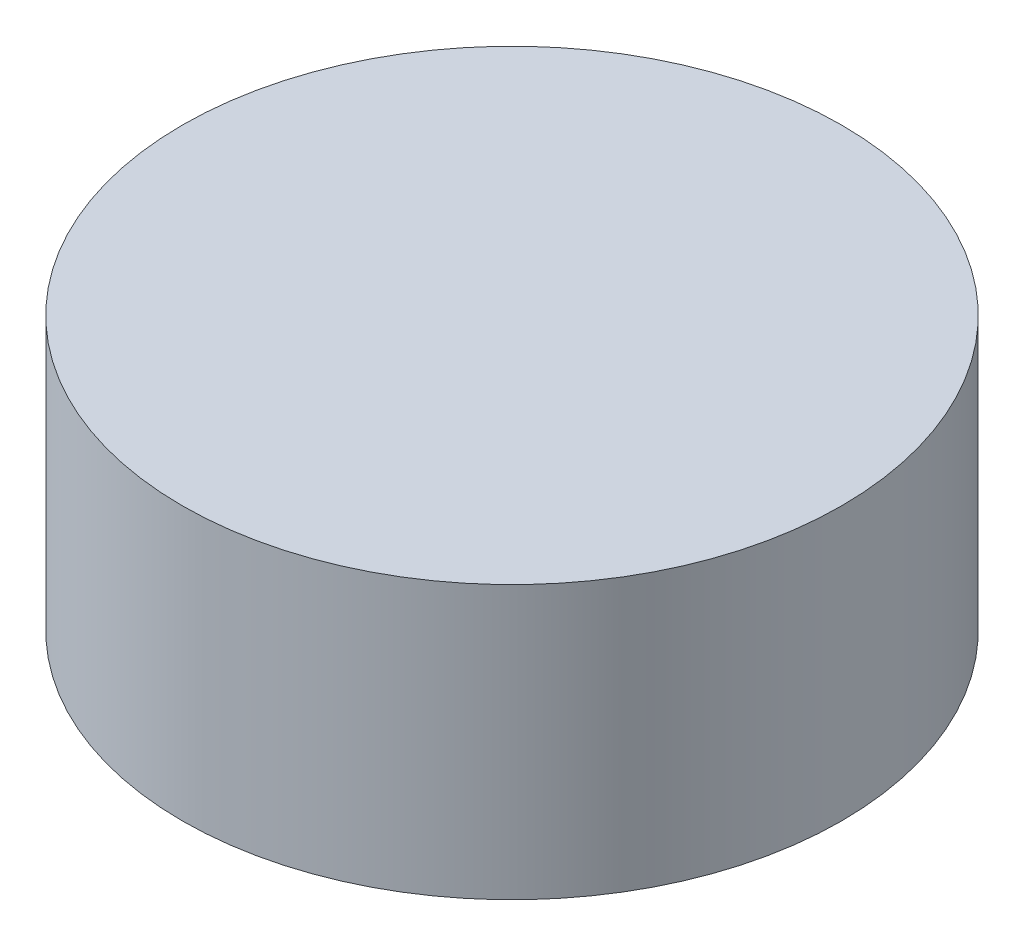
ISO-10303-21;
HEADER;
FILE_DESCRIPTION(('STEP AP214'),'2;1');
FILE_NAME('part.step','',(''),(''),'','','');
FILE_SCHEMA(('AUTOMOTIVE_DESIGN { 1 0 10303 214 1 1 1 1 }'));
ENDSEC;
DATA;
#1=APPLICATION_CONTEXT('core data for automotive mechanical design processes');
#2=APPLICATION_PROTOCOL_DEFINITION('international standard','automotive_design',2000,#1);
#3=PRODUCT_CONTEXT('',#1,'mechanical');
#4=PRODUCT('Part','Part','',(#3));
#5=PRODUCT_RELATED_PRODUCT_CATEGORY('part','',(#4));
#6=PRODUCT_DEFINITION_FORMATION('','',#4);
#7=PRODUCT_DEFINITION_CONTEXT('part definition',#1,'design');
#8=PRODUCT_DEFINITION('design','',#6,#7);
#9=PRODUCT_DEFINITION_SHAPE('','',#8);
#10=(LENGTH_UNIT() NAMED_UNIT(*) SI_UNIT(.MILLI.,.METRE.));
#11=(NAMED_UNIT(*) PLANE_ANGLE_UNIT() SI_UNIT($,.RADIAN.));
#12=(NAMED_UNIT(*) SI_UNIT($,.STERADIAN.) SOLID_ANGLE_UNIT());
#13=UNCERTAINTY_MEASURE_WITH_UNIT(LENGTH_MEASURE(1.E-05),#10,'distance_accuracy_value','');
#14=(GEOMETRIC_REPRESENTATION_CONTEXT(3) GLOBAL_UNCERTAINTY_ASSIGNED_CONTEXT((#13)) GLOBAL_UNIT_ASSIGNED_CONTEXT((#10,
#11,#12)) REPRESENTATION_CONTEXT('',''));
#15=CARTESIAN_POINT('',(0.,0.,0.));
#16=DIRECTION('',(0.,0.,1.));
#17=DIRECTION('',(1.,0.,0.));
#18=AXIS2_PLACEMENT_3D('',#15,#16,#17);
#19=CARTESIAN_POINT('',(-42.7866665549931,0.,20.4642477072215));
#20=DIRECTION('',(0.,1.,0.));
#21=DIRECTION('',(0.,0.,1.));
#22=AXIS2_PLACEMENT_3D('',#19,#20,#21);
#23=PLANE('',#22);
#24=CARTESIAN_POINT('',(-46.4462373264577,0.,0.));
#25=DIRECTION('',(0.,1.,0.));
#26=DIRECTION('',(0.,0.,1.));
#27=AXIS2_PLACEMENT_3D('',#24,#25,#26);
#28=CIRCLE('',#27,12.080035709711);
#29=CARTESIAN_POINT('',(-46.4462373264577,0.,12.080035709711));
#30=VERTEX_POINT('',#29);
#31=EDGE_CURVE('E10',#30,#30,#28,.T.);
#32=ORIENTED_EDGE('',*,*,#31,.F.);
#33=EDGE_LOOP('',(#32));
#34=FACE_BOUND('',#33,.T.);
#35=ADVANCED_FACE('F31',(#34),#23,.F.);
#36=CARTESIAN_POINT('',(-46.4462373264577,0.,0.));
#37=DIRECTION('',(0.,1.,0.));
#38=DIRECTION('',(0.,0.,1.));
#39=AXIS2_PLACEMENT_3D('',#36,#37,#38);
#40=CYLINDRICAL_SURFACE('',#39,12.080035709711);
#41=ORIENTED_EDGE('',*,*,#31,.T.);
#42=EDGE_LOOP('',(#41));
#43=FACE_BOUND('',#42,.T.);
#44=CARTESIAN_POINT('',(-46.4462373264577,10.,0.));
#45=DIRECTION('',(0.,1.,0.));
#46=DIRECTION('',(0.,0.,1.));
#47=AXIS2_PLACEMENT_3D('',#44,#45,#46);
#48=CIRCLE('',#47,12.080035709711);
#49=CARTESIAN_POINT('',(-46.4462373264577,10.,12.080035709711));
#50=VERTEX_POINT('',#49);
#51=EDGE_CURVE('E34',#50,#50,#48,.T.);
#52=ORIENTED_EDGE('',*,*,#51,.F.);
#53=EDGE_LOOP('',(#52));
#54=FACE_BOUND('',#53,.T.);
#55=ADVANCED_FACE('F45',(#43,#54),#40,.T.);
#56=CARTESIAN_POINT('',(-42.7866665549931,10.,20.4642477072215));
#57=DIRECTION('',(0.,1.,0.));
#58=DIRECTION('',(0.,0.,1.));
#59=AXIS2_PLACEMENT_3D('',#56,#57,#58);
#60=PLANE('',#59);
#61=ORIENTED_EDGE('',*,*,#51,.T.);
#62=EDGE_LOOP('',(#61));
#63=FACE_BOUND('',#62,.T.);
#64=ADVANCED_FACE('F43',(#63),#60,.T.);
#65=CLOSED_SHELL('',(#35,#55,#64));
#66=MANIFOLD_SOLID_BREP('B2',#65);
#67=ADVANCED_BREP_SHAPE_REPRESENTATION('',(#18,#66),#14);
#68=SHAPE_DEFINITION_REPRESENTATION(#9,#67);
ENDSEC;
END-ISO-10303-21;
